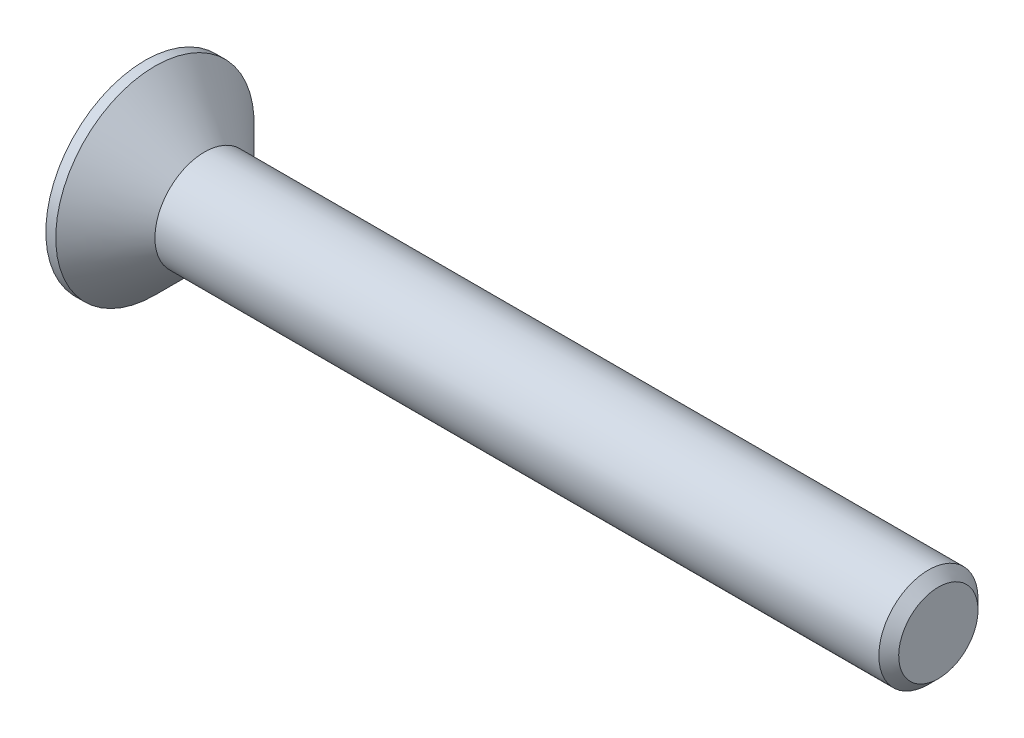
ISO-10303-21;
HEADER;
FILE_DESCRIPTION(('STEP AP214'),'2;1');
FILE_NAME('part.step','',(''),(''),'','','');
FILE_SCHEMA(('AUTOMOTIVE_DESIGN { 1 0 10303 214 1 1 1 1 }'));
ENDSEC;
DATA;
#1=APPLICATION_CONTEXT('core data for automotive mechanical design processes');
#2=APPLICATION_PROTOCOL_DEFINITION('international standard','automotive_design',2000,#1);
#3=PRODUCT_CONTEXT('',#1,'mechanical');
#4=PRODUCT('Part','Part','',(#3));
#5=PRODUCT_RELATED_PRODUCT_CATEGORY('part','',(#4));
#6=PRODUCT_DEFINITION_FORMATION('','',#4);
#7=PRODUCT_DEFINITION_CONTEXT('part definition',#1,'design');
#8=PRODUCT_DEFINITION('design','',#6,#7);
#9=PRODUCT_DEFINITION_SHAPE('','',#8);
#10=(LENGTH_UNIT() NAMED_UNIT(*) SI_UNIT(.MILLI.,.METRE.));
#11=(NAMED_UNIT(*) PLANE_ANGLE_UNIT() SI_UNIT($,.RADIAN.));
#12=(NAMED_UNIT(*) SI_UNIT($,.STERADIAN.) SOLID_ANGLE_UNIT());
#13=UNCERTAINTY_MEASURE_WITH_UNIT(LENGTH_MEASURE(1.E-05),#10,'distance_accuracy_value','');
#14=(GEOMETRIC_REPRESENTATION_CONTEXT(3) GLOBAL_UNCERTAINTY_ASSIGNED_CONTEXT((#13)) GLOBAL_UNIT_ASSIGNED_CONTEXT((#10,
#11,#12)) REPRESENTATION_CONTEXT('',''));
#15=CARTESIAN_POINT('',(0.,0.,0.));
#16=DIRECTION('',(0.,0.,1.));
#17=DIRECTION('',(1.,0.,0.));
#18=AXIS2_PLACEMENT_3D('',#15,#16,#17);
#19=CARTESIAN_POINT('',(-1.2,0.,0.));
#20=DIRECTION('',(-1.,0.,0.));
#21=DIRECTION('',(0.,-1.,0.));
#22=AXIS2_PLACEMENT_3D('',#19,#20,#21);
#23=CYLINDRICAL_SURFACE('',#22,1.);
#24=CARTESIAN_POINT('',(14.6,0.,0.));
#25=DIRECTION('',(-1.,0.,0.));
#26=DIRECTION('',(0.,-1.,0.));
#27=AXIS2_PLACEMENT_3D('',#24,#25,#26);
#28=CIRCLE('',#27,1.);
#29=CARTESIAN_POINT('',(14.6,-1.,0.));
#30=VERTEX_POINT('',#29);
#31=EDGE_CURVE('E42',#30,#30,#28,.T.);
#32=ORIENTED_EDGE('',*,*,#31,.T.);
#33=EDGE_LOOP('',(#32));
#34=FACE_BOUND('',#33,.T.);
#35=CARTESIAN_POINT('',(0.,0.,0.));
#36=DIRECTION('',(-1.,0.,0.));
#37=DIRECTION('',(0.,-1.,0.));
#38=AXIS2_PLACEMENT_3D('',#35,#36,#37);
#39=CIRCLE('',#38,1.);
#40=CARTESIAN_POINT('',(0.,-1.,0.));
#41=VERTEX_POINT('',#40);
#42=EDGE_CURVE('E147',#41,#41,#39,.T.);
#43=ORIENTED_EDGE('',*,*,#42,.F.);
#44=EDGE_LOOP('',(#43));
#45=FACE_BOUND('',#44,.T.);
#46=ADVANCED_FACE('F34',(#34,#45),#23,.T.);
#47=CARTESIAN_POINT('',(0.,0.,0.));
#48=DIRECTION('',(-1.,0.,0.));
#49=DIRECTION('',(0.,-1.,0.));
#50=AXIS2_PLACEMENT_3D('',#47,#48,#49);
#51=CONICAL_SURFACE('',#50,1.,0.785398163397444);
#52=CARTESIAN_POINT('',(-1.00000000000001,0.,0.));
#53=DIRECTION('',(-1.,0.,0.));
#54=DIRECTION('',(0.,-1.,0.));
#55=AXIS2_PLACEMENT_3D('',#52,#53,#54);
#56=CIRCLE('',#55,2.);
#57=CARTESIAN_POINT('',(-1.00000000000001,-2.,0.));
#58=VERTEX_POINT('',#57);
#59=EDGE_CURVE('E144',#58,#58,#56,.T.);
#60=ORIENTED_EDGE('',*,*,#59,.F.);
#61=EDGE_LOOP('',(#60));
#62=FACE_BOUND('',#61,.T.);
#63=ORIENTED_EDGE('',*,*,#42,.T.);
#64=EDGE_LOOP('',(#63));
#65=FACE_BOUND('',#64,.T.);
#66=ADVANCED_FACE('F169',(#62,#65),#51,.T.);
#67=CARTESIAN_POINT('',(-1.2,0.,0.));
#68=DIRECTION('',(-1.,0.,0.));
#69=DIRECTION('',(0.,-1.,0.));
#70=AXIS2_PLACEMENT_3D('',#67,#68,#69);
#71=CYLINDRICAL_SURFACE('',#70,2.);
#72=CARTESIAN_POINT('',(-1.2,0.,0.));
#73=DIRECTION('',(-1.,0.,0.));
#74=DIRECTION('',(0.,-1.,0.));
#75=AXIS2_PLACEMENT_3D('',#72,#73,#74);
#76=CIRCLE('',#75,2.);
#77=CARTESIAN_POINT('',(-1.2,-2.,0.));
#78=VERTEX_POINT('',#77);
#79=EDGE_CURVE('E136',#78,#78,#76,.T.);
#80=ORIENTED_EDGE('',*,*,#79,.F.);
#81=EDGE_LOOP('',(#80));
#82=FACE_BOUND('',#81,.T.);
#83=ORIENTED_EDGE('',*,*,#59,.T.);
#84=EDGE_LOOP('',(#83));
#85=FACE_BOUND('',#84,.T.);
#86=ADVANCED_FACE('F173',(#82,#85),#71,.T.);
#87=CARTESIAN_POINT('',(-1.2,2.,0.));
#88=DIRECTION('',(1.,0.,0.));
#89=DIRECTION('',(0.,1.,0.));
#90=AXIS2_PLACEMENT_3D('',#87,#88,#89);
#91=PLANE('',#90);
#92=DIRECTION('',(0.,-0.866025403784439,0.5));
#93=VECTOR('',#92,1.);
#94=CARTESIAN_POINT('',(-1.2,0.,-0.750555349946514));
#95=LINE('',#94,#93);
#96=CARTESIAN_POINT('',(-1.2,0.,-0.750555349946513));
#97=VERTEX_POINT('',#96);
#98=CARTESIAN_POINT('',(-1.2,-0.65,-0.375277674973257));
#99=VERTEX_POINT('',#98);
#100=EDGE_CURVE('E123',#97,#99,#95,.T.);
#101=ORIENTED_EDGE('',*,*,#100,.F.);
#102=DIRECTION('',(0.,-0.866025403784438,-0.5));
#103=VECTOR('',#102,1.);
#104=CARTESIAN_POINT('',(-1.2,0.65,-0.375277674973257));
#105=LINE('',#104,#103);
#106=CARTESIAN_POINT('',(-1.2,0.65,-0.375277674973257));
#107=VERTEX_POINT('',#106);
#108=EDGE_CURVE('E49',#107,#97,#105,.T.);
#109=ORIENTED_EDGE('',*,*,#108,.F.);
#110=DIRECTION('',(0.,0.,-1.));
#111=VECTOR('',#110,1.);
#112=CARTESIAN_POINT('',(-1.2,0.65,0.375277674973257));
#113=LINE('',#112,#111);
#114=CARTESIAN_POINT('',(-1.2,0.65,0.375277674973257));
#115=VERTEX_POINT('',#114);
#116=EDGE_CURVE('E132',#115,#107,#113,.T.);
#117=ORIENTED_EDGE('',*,*,#116,.F.);
#118=DIRECTION('',(0.,0.866025403784439,-0.5));
#119=VECTOR('',#118,1.);
#120=CARTESIAN_POINT('',(-1.2,0.,0.750555349946513));
#121=LINE('',#120,#119);
#122=CARTESIAN_POINT('',(-1.2,0.,0.750555349946513));
#123=VERTEX_POINT('',#122);
#124=EDGE_CURVE('E130',#123,#115,#121,.T.);
#125=ORIENTED_EDGE('',*,*,#124,.F.);
#126=DIRECTION('',(0.,0.866025403784439,0.5));
#127=VECTOR('',#126,1.);
#128=CARTESIAN_POINT('',(-1.2,-0.65,0.375277674973257));
#129=LINE('',#128,#127);
#130=CARTESIAN_POINT('',(-1.2,-0.65,0.375277674973257));
#131=VERTEX_POINT('',#130);
#132=EDGE_CURVE('E97',#131,#123,#129,.T.);
#133=ORIENTED_EDGE('',*,*,#132,.F.);
#134=DIRECTION('',(0.,0.,1.));
#135=VECTOR('',#134,1.);
#136=CARTESIAN_POINT('',(-1.2,-0.65,-0.375277674973257));
#137=LINE('',#136,#135);
#138=EDGE_CURVE('E126',#99,#131,#137,.T.);
#139=ORIENTED_EDGE('',*,*,#138,.F.);
#140=EDGE_LOOP('',(#101,#109,#117,#125,#133,#139));
#141=FACE_BOUND('',#140,.T.);
#142=ORIENTED_EDGE('',*,*,#79,.T.);
#143=EDGE_LOOP('',(#142));
#144=FACE_BOUND('',#143,.T.);
#145=ADVANCED_FACE('F164',(#141,#144),#91,.F.);
#146=CARTESIAN_POINT('',(14.8,0.,0.));
#147=DIRECTION('',(-1.,0.,0.));
#148=DIRECTION('',(0.,-1.,0.));
#149=AXIS2_PLACEMENT_3D('',#146,#147,#148);
#150=PLANE('',#149);
#151=CARTESIAN_POINT('',(14.8,0.,0.));
#152=DIRECTION('',(-1.,0.,0.));
#153=DIRECTION('',(0.,-1.,0.));
#154=AXIS2_PLACEMENT_3D('',#151,#152,#153);
#155=CIRCLE('',#154,0.8);
#156=CARTESIAN_POINT('',(14.8,-0.8,0.));
#157=VERTEX_POINT('',#156);
#158=EDGE_CURVE('E11',#157,#157,#155,.F.);
#159=ORIENTED_EDGE('',*,*,#158,.T.);
#160=EDGE_LOOP('',(#159));
#161=FACE_BOUND('',#160,.T.);
#162=ADVANCED_FACE('F156',(#161),#150,.F.);
#163=CARTESIAN_POINT('',(14.6,0.,0.));
#164=DIRECTION('',(-1.,0.,0.));
#165=DIRECTION('',(0.,-1.,0.));
#166=AXIS2_PLACEMENT_3D('',#163,#164,#165);
#167=CONICAL_SURFACE('',#166,1.,0.785398163397442);
#168=ORIENTED_EDGE('',*,*,#158,.F.);
#169=EDGE_LOOP('',(#168));
#170=FACE_BOUND('',#169,.T.);
#171=ORIENTED_EDGE('',*,*,#31,.F.);
#172=EDGE_LOOP('',(#171));
#173=FACE_BOUND('',#172,.T.);
#174=ADVANCED_FACE('F36',(#170,#173),#167,.T.);
#175=CARTESIAN_POINT('',(-0.45,0.65,-0.375277674973257));
#176=DIRECTION('',(0.,0.5,-0.866025403784439));
#177=DIRECTION('',(0.,0.866025403784439,0.5));
#178=AXIS2_PLACEMENT_3D('',#175,#176,#177);
#179=PLANE('',#178);
#180=ORIENTED_EDGE('',*,*,#108,.T.);
#181=DIRECTION('',(-1.,0.,0.));
#182=VECTOR('',#181,1.);
#183=CARTESIAN_POINT('',(-0.45,0.,-0.750555349946514));
#184=LINE('',#183,#182);
#185=CARTESIAN_POINT('',(-0.45,0.,-0.750555349946514));
#186=VERTEX_POINT('',#185);
#187=EDGE_CURVE('E79',#186,#97,#184,.T.);
#188=ORIENTED_EDGE('',*,*,#187,.F.);
#189=DIRECTION('',(0.,-0.866025403784438,-0.5));
#190=VECTOR('',#189,1.);
#191=CARTESIAN_POINT('',(-0.45,0.65,-0.375277674973257));
#192=LINE('',#191,#190);
#193=CARTESIAN_POINT('',(-0.45,0.65,-0.375277674973257));
#194=VERTEX_POINT('',#193);
#195=EDGE_CURVE('E134',#194,#186,#192,.T.);
#196=ORIENTED_EDGE('',*,*,#195,.F.);
#197=DIRECTION('',(-1.,0.,0.));
#198=VECTOR('',#197,1.);
#199=CARTESIAN_POINT('',(-0.45,0.65,-0.375277674973257));
#200=LINE('',#199,#198);
#201=EDGE_CURVE('E57',#194,#107,#200,.T.);
#202=ORIENTED_EDGE('',*,*,#201,.T.);
#203=EDGE_LOOP('',(#180,#188,#196,#202));
#204=FACE_BOUND('',#203,.T.);
#205=ADVANCED_FACE('F155',(#204),#179,.F.);
#206=CARTESIAN_POINT('',(-0.45,0.65,0.375277674973257));
#207=DIRECTION('',(0.,1.,0.));
#208=DIRECTION('',(0.,0.,1.));
#209=AXIS2_PLACEMENT_3D('',#206,#207,#208);
#210=PLANE('',#209);
#211=ORIENTED_EDGE('',*,*,#116,.T.);
#212=ORIENTED_EDGE('',*,*,#201,.F.);
#213=DIRECTION('',(0.,0.,-1.));
#214=VECTOR('',#213,1.);
#215=CARTESIAN_POINT('',(-0.45,0.65,0.375277674973257));
#216=LINE('',#215,#214);
#217=CARTESIAN_POINT('',(-0.45,0.65,0.375277674973257));
#218=VERTEX_POINT('',#217);
#219=EDGE_CURVE('E109',#218,#194,#216,.T.);
#220=ORIENTED_EDGE('',*,*,#219,.F.);
#221=DIRECTION('',(-1.,0.,0.));
#222=VECTOR('',#221,1.);
#223=CARTESIAN_POINT('',(-0.45,0.65,0.375277674973257));
#224=LINE('',#223,#222);
#225=EDGE_CURVE('E101',#218,#115,#224,.T.);
#226=ORIENTED_EDGE('',*,*,#225,.T.);
#227=EDGE_LOOP('',(#211,#212,#220,#226));
#228=FACE_BOUND('',#227,.T.);
#229=ADVANCED_FACE('F162',(#228),#210,.F.);
#230=CARTESIAN_POINT('',(-0.45,0.,0.750555349946513));
#231=DIRECTION('',(0.,0.5,0.866025403784439));
#232=DIRECTION('',(0.,-0.866025403784439,0.5));
#233=AXIS2_PLACEMENT_3D('',#230,#231,#232);
#234=PLANE('',#233);
#235=ORIENTED_EDGE('',*,*,#124,.T.);
#236=ORIENTED_EDGE('',*,*,#225,.F.);
#237=DIRECTION('',(0.,0.866025403784439,-0.5));
#238=VECTOR('',#237,1.);
#239=CARTESIAN_POINT('',(-0.45,0.,0.750555349946513));
#240=LINE('',#239,#238);
#241=CARTESIAN_POINT('',(-0.45,0.,0.750555349946513));
#242=VERTEX_POINT('',#241);
#243=EDGE_CURVE('E105',#242,#218,#240,.T.);
#244=ORIENTED_EDGE('',*,*,#243,.F.);
#245=DIRECTION('',(-1.,0.,0.));
#246=VECTOR('',#245,1.);
#247=CARTESIAN_POINT('',(-0.45,0.,0.750555349946513));
#248=LINE('',#247,#246);
#249=EDGE_CURVE('E90',#242,#123,#248,.T.);
#250=ORIENTED_EDGE('',*,*,#249,.T.);
#251=EDGE_LOOP('',(#235,#236,#244,#250));
#252=FACE_BOUND('',#251,.T.);
#253=ADVANCED_FACE('F106',(#252),#234,.F.);
#254=CARTESIAN_POINT('',(-0.45,-0.65,0.375277674973257));
#255=DIRECTION('',(0.,-0.5,0.866025403784439));
#256=DIRECTION('',(0.,-0.866025403784439,-0.5));
#257=AXIS2_PLACEMENT_3D('',#254,#255,#256);
#258=PLANE('',#257);
#259=ORIENTED_EDGE('',*,*,#132,.T.);
#260=ORIENTED_EDGE('',*,*,#249,.F.);
#261=DIRECTION('',(0.,0.866025403784439,0.5));
#262=VECTOR('',#261,1.);
#263=CARTESIAN_POINT('',(-0.45,-0.65,0.375277674973257));
#264=LINE('',#263,#262);
#265=CARTESIAN_POINT('',(-0.45,-0.65,0.375277674973257));
#266=VERTEX_POINT('',#265);
#267=EDGE_CURVE('E94',#266,#242,#264,.T.);
#268=ORIENTED_EDGE('',*,*,#267,.F.);
#269=DIRECTION('',(-1.,0.,0.));
#270=VECTOR('',#269,1.);
#271=CARTESIAN_POINT('',(-0.45,-0.65,0.375277674973257));
#272=LINE('',#271,#270);
#273=EDGE_CURVE('E102',#266,#131,#272,.T.);
#274=ORIENTED_EDGE('',*,*,#273,.T.);
#275=EDGE_LOOP('',(#259,#260,#268,#274));
#276=FACE_BOUND('',#275,.T.);
#277=ADVANCED_FACE('F92',(#276),#258,.F.);
#278=CARTESIAN_POINT('',(-0.45,-0.65,-0.375277674973257));
#279=DIRECTION('',(0.,-1.,0.));
#280=DIRECTION('',(0.,0.,-1.));
#281=AXIS2_PLACEMENT_3D('',#278,#279,#280);
#282=PLANE('',#281);
#283=ORIENTED_EDGE('',*,*,#138,.T.);
#284=ORIENTED_EDGE('',*,*,#273,.F.);
#285=DIRECTION('',(0.,0.,1.));
#286=VECTOR('',#285,1.);
#287=CARTESIAN_POINT('',(-0.45,-0.65,-0.375277674973257));
#288=LINE('',#287,#286);
#289=CARTESIAN_POINT('',(-0.45,-0.65,-0.375277674973257));
#290=VERTEX_POINT('',#289);
#291=EDGE_CURVE('E115',#290,#266,#288,.T.);
#292=ORIENTED_EDGE('',*,*,#291,.F.);
#293=DIRECTION('',(-1.,0.,0.));
#294=VECTOR('',#293,1.);
#295=CARTESIAN_POINT('',(-0.45,-0.65,-0.375277674973257));
#296=LINE('',#295,#294);
#297=EDGE_CURVE('E139',#290,#99,#296,.T.);
#298=ORIENTED_EDGE('',*,*,#297,.T.);
#299=EDGE_LOOP('',(#283,#284,#292,#298));
#300=FACE_BOUND('',#299,.T.);
#301=ADVANCED_FACE('F186',(#300),#282,.F.);
#302=CARTESIAN_POINT('',(-0.45,0.,-0.750555349946514));
#303=DIRECTION('',(0.,-0.5,-0.866025403784439));
#304=DIRECTION('',(0.,0.866025403784439,-0.5));
#305=AXIS2_PLACEMENT_3D('',#302,#303,#304);
#306=PLANE('',#305);
#307=ORIENTED_EDGE('',*,*,#100,.T.);
#308=ORIENTED_EDGE('',*,*,#297,.F.);
#309=DIRECTION('',(0.,-0.866025403784439,0.5));
#310=VECTOR('',#309,1.);
#311=CARTESIAN_POINT('',(-0.45,0.,-0.750555349946514));
#312=LINE('',#311,#310);
#313=EDGE_CURVE('E117',#186,#290,#312,.T.);
#314=ORIENTED_EDGE('',*,*,#313,.F.);
#315=ORIENTED_EDGE('',*,*,#187,.T.);
#316=EDGE_LOOP('',(#307,#308,#314,#315));
#317=FACE_BOUND('',#316,.T.);
#318=ADVANCED_FACE('F183',(#317),#306,.F.);
#319=CARTESIAN_POINT('',(-0.45,0.,0.));
#320=DIRECTION('',(-1.,0.,0.));
#321=DIRECTION('',(0.,0.,1.));
#322=AXIS2_PLACEMENT_3D('',#319,#320,#321);
#323=PLANE('',#322);
#324=ORIENTED_EDGE('',*,*,#195,.T.);
#325=ORIENTED_EDGE('',*,*,#313,.T.);
#326=ORIENTED_EDGE('',*,*,#291,.T.);
#327=ORIENTED_EDGE('',*,*,#267,.T.);
#328=ORIENTED_EDGE('',*,*,#243,.T.);
#329=ORIENTED_EDGE('',*,*,#219,.T.);
#330=EDGE_LOOP('',(#324,#325,#326,#327,#328,#329));
#331=FACE_BOUND('',#330,.T.);
#332=ADVANCED_FACE('F112',(#331),#323,.T.);
#333=CLOSED_SHELL('',(#46,#66,#86,#145,#162,#174,#205,#229,#253,#277,#301,#318,#332));
#334=MANIFOLD_SOLID_BREP('B2',#333);
#335=ADVANCED_BREP_SHAPE_REPRESENTATION('',(#18,#334),#14);
#336=SHAPE_DEFINITION_REPRESENTATION(#9,#335);
ENDSEC;
END-ISO-10303-21;
